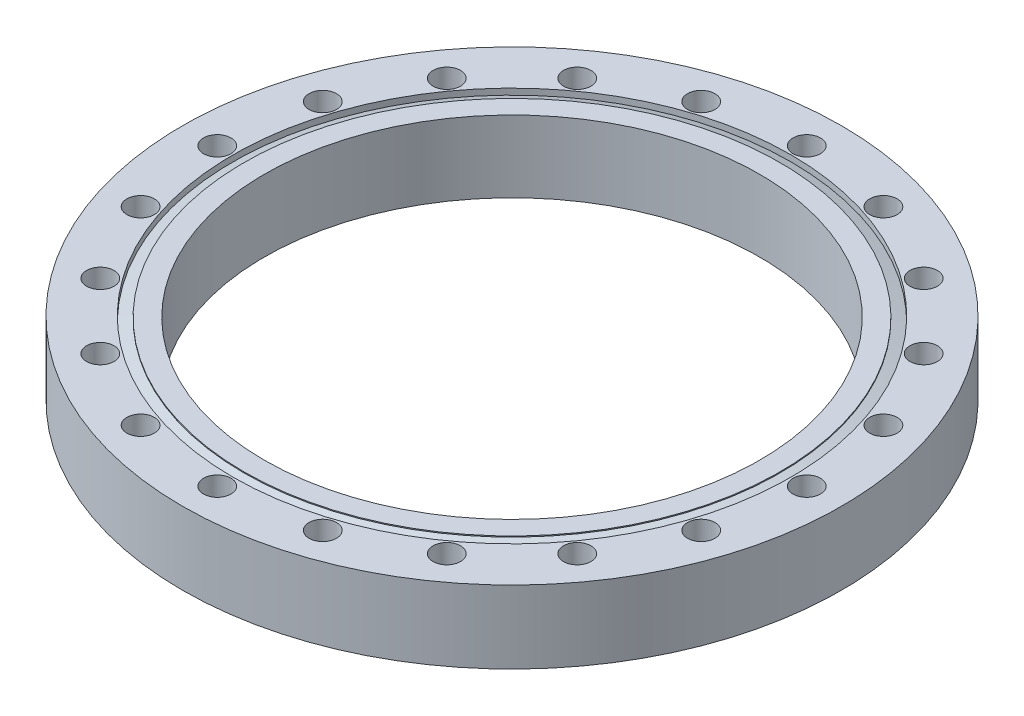
ISO-10303-21;
HEADER;
FILE_DESCRIPTION(('STEP AP214'),'2;1');
FILE_NAME('part.step','',(''),(''),'','','');
FILE_SCHEMA(('AUTOMOTIVE_DESIGN { 1 0 10303 214 1 1 1 1 }'));
ENDSEC;
DATA;
#1=APPLICATION_CONTEXT('core data for automotive mechanical design processes');
#2=APPLICATION_PROTOCOL_DEFINITION('international standard','automotive_design',2000,#1);
#3=PRODUCT_CONTEXT('',#1,'mechanical');
#4=PRODUCT('Part','Part','',(#3));
#5=PRODUCT_RELATED_PRODUCT_CATEGORY('part','',(#4));
#6=PRODUCT_DEFINITION_FORMATION('','',#4);
#7=PRODUCT_DEFINITION_CONTEXT('part definition',#1,'design');
#8=PRODUCT_DEFINITION('design','',#6,#7);
#9=PRODUCT_DEFINITION_SHAPE('','',#8);
#10=(LENGTH_UNIT() NAMED_UNIT(*) SI_UNIT(.MILLI.,.METRE.));
#11=(NAMED_UNIT(*) PLANE_ANGLE_UNIT() SI_UNIT($,.RADIAN.));
#12=(NAMED_UNIT(*) SI_UNIT($,.STERADIAN.) SOLID_ANGLE_UNIT());
#13=UNCERTAINTY_MEASURE_WITH_UNIT(LENGTH_MEASURE(1.E-05),#10,'distance_accuracy_value','');
#14=(GEOMETRIC_REPRESENTATION_CONTEXT(3) GLOBAL_UNCERTAINTY_ASSIGNED_CONTEXT((#13)) GLOBAL_UNIT_ASSIGNED_CONTEXT((#10,
#11,#12)) REPRESENTATION_CONTEXT('',''));
#15=CARTESIAN_POINT('',(0.,0.,0.));
#16=DIRECTION('',(0.,0.,1.));
#17=DIRECTION('',(1.,0.,0.));
#18=AXIS2_PLACEMENT_3D('',#15,#16,#17);
#19=CARTESIAN_POINT('',(101.219,11.176,0.));
#20=DIRECTION('',(0.,-1.,0.));
#21=DIRECTION('',(0.,0.,-1.));
#22=AXIS2_PLACEMENT_3D('',#19,#20,#21);
#23=PLANE('',#22);
#24=CARTESIAN_POINT('',(73.2367488259894,11.176,53.2096126349265));
#25=DIRECTION('',(0.,1.,0.));
#26=DIRECTION('',(-0.587785252292462,0.,0.809016994374955));
#27=AXIS2_PLACEMENT_3D('',#24,#25,#26);
#28=CIRCLE('',#27,4.21639999999999);
#29=CARTESIAN_POINT('',(70.7584110882235,11.176,56.6207518900091));
#30=VERTEX_POINT('',#29);
#31=EDGE_CURVE('E172',#30,#30,#28,.T.);
#32=ORIENTED_EDGE('',*,*,#31,.F.);
#33=EDGE_LOOP('',(#32));
#34=FACE_BOUND('',#33,.T.);
#35=CARTESIAN_POINT('',(27.9739488259897,11.176,86.0949617715282));
#36=DIRECTION('',(0.,1.,0.));
#37=DIRECTION('',(-0.95105651629515,0.,0.309016994374958));
#38=AXIS2_PLACEMENT_3D('',#35,#36,#37);
#39=CIRCLE('',#38,4.21639999999999);
#40=CARTESIAN_POINT('',(23.9639141306828,11.176,87.3979010266108));
#41=VERTEX_POINT('',#40);
#42=EDGE_CURVE('E160',#41,#41,#39,.T.);
#43=ORIENTED_EDGE('',*,*,#42,.F.);
#44=EDGE_LOOP('',(#43));
#45=FACE_BOUND('',#44,.T.);
#46=CARTESIAN_POINT('',(-27.9739488259879,11.176,86.0949617715288));
#47=DIRECTION('',(0.,1.,0.));
#48=DIRECTION('',(-0.951056516295157,0.,-0.309016994374938));
#49=AXIS2_PLACEMENT_3D('',#46,#47,#48);
#50=CIRCLE('',#49,4.21639999999999);
#51=CARTESIAN_POINT('',(-31.9839835212948,11.176,84.7920225164463));
#52=VERTEX_POINT('',#51);
#53=EDGE_CURVE('E148',#52,#52,#50,.T.);
#54=ORIENTED_EDGE('',*,*,#53,.F.);
#55=EDGE_LOOP('',(#54));
#56=FACE_BOUND('',#55,.T.);
#57=CARTESIAN_POINT('',(-73.2367488259883,11.176,53.2096126349281));
#58=DIRECTION('',(0.,1.,0.));
#59=DIRECTION('',(-0.58778525229248,0.,-0.809016994374942));
#60=AXIS2_PLACEMENT_3D('',#57,#58,#59);
#61=CIRCLE('',#60,4.21639999999999);
#62=CARTESIAN_POINT('',(-75.7150865637543,11.176,49.7984733798456));
#63=VERTEX_POINT('',#62);
#64=EDGE_CURVE('E136',#63,#63,#61,.T.);
#65=ORIENTED_EDGE('',*,*,#64,.F.);
#66=EDGE_LOOP('',(#65));
#67=FACE_BOUND('',#66,.T.);
#68=CARTESIAN_POINT('',(-90.5256,11.176,6.32137252308887E-13));
#69=DIRECTION('',(0.,1.,0.));
#70=DIRECTION('',(0.,0.,-1.));
#71=AXIS2_PLACEMENT_3D('',#68,#69,#70);
#72=CIRCLE('',#71,4.21639999999999);
#73=CARTESIAN_POINT('',(-90.5256,11.176,-4.21639999999936));
#74=VERTEX_POINT('',#73);
#75=EDGE_CURVE('E124',#74,#74,#72,.T.);
#76=ORIENTED_EDGE('',*,*,#75,.F.);
#77=EDGE_LOOP('',(#76));
#78=FACE_BOUND('',#77,.T.);
#79=CARTESIAN_POINT('',(-73.236748825989,11.176,-53.2096126349271));
#80=DIRECTION('',(0.,1.,0.));
#81=DIRECTION('',(0.587785252292469,0.,-0.809016994374951));
#82=AXIS2_PLACEMENT_3D('',#79,#80,#81);
#83=CIRCLE('',#82,4.21639999999999);
#84=CARTESIAN_POINT('',(-70.7584110882231,11.176,-56.6207518900096));
#85=VERTEX_POINT('',#84);
#86=EDGE_CURVE('E112',#85,#85,#83,.T.);
#87=ORIENTED_EDGE('',*,*,#86,.F.);
#88=EDGE_LOOP('',(#87));
#89=FACE_BOUND('',#88,.T.);
#90=CARTESIAN_POINT('',(-27.9739488259891,11.176,-86.0949617715284));
#91=DIRECTION('',(0.,1.,0.));
#92=DIRECTION('',(0.951056516295152,0.,-0.309016994374952));
#93=AXIS2_PLACEMENT_3D('',#90,#91,#92);
#94=CIRCLE('',#93,4.21639999999999);
#95=CARTESIAN_POINT('',(-23.9639141306822,11.176,-87.397901026611));
#96=VERTEX_POINT('',#95);
#97=EDGE_CURVE('E100',#96,#96,#94,.T.);
#98=ORIENTED_EDGE('',*,*,#97,.F.);
#99=EDGE_LOOP('',(#98));
#100=FACE_BOUND('',#99,.T.);
#101=CARTESIAN_POINT('',(27.9739488259885,11.176,-86.0949617715286));
#102=DIRECTION('',(0.,1.,0.));
#103=DIRECTION('',(0.951056516295155,0.,0.309016994374945));
#104=AXIS2_PLACEMENT_3D('',#101,#102,#103);
#105=CIRCLE('',#104,4.21639999999999);
#106=CARTESIAN_POINT('',(31.9839835212954,11.176,-84.7920225164461));
#107=VERTEX_POINT('',#106);
#108=EDGE_CURVE('E88',#107,#107,#105,.T.);
#109=ORIENTED_EDGE('',*,*,#108,.F.);
#110=EDGE_LOOP('',(#109));
#111=FACE_BOUND('',#110,.T.);
#112=CARTESIAN_POINT('',(73.2367488259887,11.176,-53.2096126349276));
#113=DIRECTION('',(0.,1.,0.));
#114=DIRECTION('',(0.587785252292474,0.,0.809016994374947));
#115=AXIS2_PLACEMENT_3D('',#112,#113,#114);
#116=CIRCLE('',#115,4.21639999999999);
#117=CARTESIAN_POINT('',(75.7150865637547,11.176,-49.7984733798451));
#118=VERTEX_POINT('',#117);
#119=EDGE_CURVE('E76',#118,#118,#116,.T.);
#120=ORIENTED_EDGE('',*,*,#119,.F.);
#121=EDGE_LOOP('',(#120));
#122=FACE_BOUND('',#121,.T.);
#123=CARTESIAN_POINT('',(90.5256,11.176,0.));
#124=DIRECTION('',(0.,1.,0.));
#125=DIRECTION('',(0.,0.,1.));
#126=AXIS2_PLACEMENT_3D('',#123,#124,#125);
#127=CIRCLE('',#126,4.21639999999999);
#128=CARTESIAN_POINT('',(90.5256,11.176,4.21639999999999));
#129=VERTEX_POINT('',#128);
#130=EDGE_CURVE('E64',#129,#129,#127,.T.);
#131=ORIENTED_EDGE('',*,*,#130,.F.);
#132=EDGE_LOOP('',(#131));
#133=FACE_BOUND('',#132,.T.);
#134=CARTESIAN_POINT('',(0.,11.176,0.));
#135=DIRECTION('',(0.,1.,0.));
#136=DIRECTION('',(0.,0.,1.));
#137=AXIS2_PLACEMENT_3D('',#134,#135,#136);
#138=CIRCLE('',#137,85.725);
#139=CARTESIAN_POINT('',(0.,11.176,85.725));
#140=VERTEX_POINT('',#139);
#141=EDGE_CURVE('E10',#140,#140,#138,.T.);
#142=ORIENTED_EDGE('',*,*,#141,.F.);
#143=EDGE_LOOP('',(#142));
#144=FACE_BOUND('',#143,.T.);
#145=CARTESIAN_POINT('',(0.,11.176,0.));
#146=DIRECTION('',(0.,1.,0.));
#147=DIRECTION('',(0.,0.,1.));
#148=AXIS2_PLACEMENT_3D('',#145,#146,#147);
#149=CIRCLE('',#148,101.219);
#150=CARTESIAN_POINT('',(0.,11.176,101.219));
#151=VERTEX_POINT('',#150);
#152=EDGE_CURVE('E58',#151,#151,#149,.T.);
#153=ORIENTED_EDGE('',*,*,#152,.T.);
#154=EDGE_LOOP('',(#153));
#155=FACE_BOUND('',#154,.T.);
#156=CARTESIAN_POINT('',(86.0949617715285,11.176,-27.9739488259888));
#157=DIRECTION('',(0.,1.,0.));
#158=DIRECTION('',(0.309016994374948,0.,0.951056516295154));
#159=AXIS2_PLACEMENT_3D('',#156,#157,#158);
#160=CIRCLE('',#159,4.21639999999999);
#161=CARTESIAN_POINT('',(87.3979010266111,11.176,-23.9639141306819));
#162=VERTEX_POINT('',#161);
#163=EDGE_CURVE('E70',#162,#162,#160,.T.);
#164=ORIENTED_EDGE('',*,*,#163,.F.);
#165=EDGE_LOOP('',(#164));
#166=FACE_BOUND('',#165,.T.);
#167=CARTESIAN_POINT('',(53.2096126349273,11.176,-73.2367488259889));
#168=DIRECTION('',(0.,1.,0.));
#169=DIRECTION('',(0.809016994374949,0.,0.587785252292471));
#170=AXIS2_PLACEMENT_3D('',#167,#168,#169);
#171=CIRCLE('',#170,4.21639999999999);
#172=CARTESIAN_POINT('',(56.6207518900099,11.176,-70.7584110882229));
#173=VERTEX_POINT('',#172);
#174=EDGE_CURVE('E82',#173,#173,#171,.T.);
#175=ORIENTED_EDGE('',*,*,#174,.F.);
#176=EDGE_LOOP('',(#175));
#177=FACE_BOUND('',#176,.T.);
#178=CARTESIAN_POINT('',(-3.16068626154443E-13,11.176,-90.5256));
#179=DIRECTION('',(0.,1.,0.));
#180=DIRECTION('',(1.,0.,0.));
#181=AXIS2_PLACEMENT_3D('',#178,#179,#180);
#182=CIRCLE('',#181,4.21639999999999);
#183=CARTESIAN_POINT('',(4.21639999999968,11.176,-90.5256));
#184=VERTEX_POINT('',#183);
#185=EDGE_CURVE('E94',#184,#184,#182,.T.);
#186=ORIENTED_EDGE('',*,*,#185,.F.);
#187=EDGE_LOOP('',(#186));
#188=FACE_BOUND('',#187,.T.);
#189=CARTESIAN_POINT('',(-53.2096126349279,11.176,-73.2367488259885));
#190=DIRECTION('',(0.,1.,0.));
#191=DIRECTION('',(0.809016994374945,0.,-0.587785252292477));
#192=AXIS2_PLACEMENT_3D('',#189,#190,#191);
#193=CIRCLE('',#192,4.21639999999999);
#194=CARTESIAN_POINT('',(-49.7984733798453,11.176,-75.7150865637545));
#195=VERTEX_POINT('',#194);
#196=EDGE_CURVE('E106',#195,#195,#193,.T.);
#197=ORIENTED_EDGE('',*,*,#196,.F.);
#198=EDGE_LOOP('',(#197));
#199=FACE_BOUND('',#198,.T.);
#200=CARTESIAN_POINT('',(-86.0949617715287,11.176,-27.9739488259882));
#201=DIRECTION('',(0.,1.,0.));
#202=DIRECTION('',(0.309016994374941,0.,-0.951056516295156));
#203=AXIS2_PLACEMENT_3D('',#200,#201,#202);
#204=CIRCLE('',#203,4.21639999999999);
#205=CARTESIAN_POINT('',(-84.7920225164462,11.176,-31.9839835212951));
#206=VERTEX_POINT('',#205);
#207=EDGE_CURVE('E118',#206,#206,#204,.T.);
#208=ORIENTED_EDGE('',*,*,#207,.F.);
#209=EDGE_LOOP('',(#208));
#210=FACE_BOUND('',#209,.T.);
#211=CARTESIAN_POINT('',(-86.0949617715283,11.176,27.9739488259894));
#212=DIRECTION('',(0.,1.,0.));
#213=DIRECTION('',(-0.309016994374955,0.,-0.951056516295151));
#214=AXIS2_PLACEMENT_3D('',#211,#212,#213);
#215=CIRCLE('',#214,4.21639999999999);
#216=CARTESIAN_POINT('',(-87.3979010266109,11.176,23.9639141306826));
#217=VERTEX_POINT('',#216);
#218=EDGE_CURVE('E130',#217,#217,#215,.T.);
#219=ORIENTED_EDGE('',*,*,#218,.F.);
#220=EDGE_LOOP('',(#219));
#221=FACE_BOUND('',#220,.T.);
#222=CARTESIAN_POINT('',(-53.2096126349268,11.176,73.2367488259893));
#223=DIRECTION('',(0.,1.,0.));
#224=DIRECTION('',(-0.809016994374953,0.,-0.587785252292465));
#225=AXIS2_PLACEMENT_3D('',#222,#223,#224);
#226=CIRCLE('',#225,4.21639999999999);
#227=CARTESIAN_POINT('',(-56.6207518900093,11.176,70.7584110882233));
#228=VERTEX_POINT('',#227);
#229=EDGE_CURVE('E142',#228,#228,#226,.T.);
#230=ORIENTED_EDGE('',*,*,#229,.F.);
#231=EDGE_LOOP('',(#230));
#232=FACE_BOUND('',#231,.T.);
#233=CARTESIAN_POINT('',(9.4820587846333E-13,11.176,90.5256));
#234=DIRECTION('',(0.,1.,0.));
#235=DIRECTION('',(-1.,0.,0.));
#236=AXIS2_PLACEMENT_3D('',#233,#234,#235);
#237=CIRCLE('',#236,4.21639999999999);
#238=CARTESIAN_POINT('',(-4.21639999999905,11.176,90.5256));
#239=VERTEX_POINT('',#238);
#240=EDGE_CURVE('E154',#239,#239,#237,.T.);
#241=ORIENTED_EDGE('',*,*,#240,.F.);
#242=EDGE_LOOP('',(#241));
#243=FACE_BOUND('',#242,.T.);
#244=CARTESIAN_POINT('',(53.2096126349284,11.176,73.2367488259881));
#245=DIRECTION('',(0.,1.,0.));
#246=DIRECTION('',(-0.80901699437494,0.,0.587785252292483));
#247=AXIS2_PLACEMENT_3D('',#244,#245,#246);
#248=CIRCLE('',#247,4.21639999999999);
#249=CARTESIAN_POINT('',(49.7984733798459,11.176,75.7150865637541));
#250=VERTEX_POINT('',#249);
#251=EDGE_CURVE('E166',#250,#250,#248,.T.);
#252=ORIENTED_EDGE('',*,*,#251,.F.);
#253=EDGE_LOOP('',(#252));
#254=FACE_BOUND('',#253,.T.);
#255=CARTESIAN_POINT('',(86.0949617715289,11.176,27.9739488259876));
#256=DIRECTION('',(0.,1.,0.));
#257=DIRECTION('',(-0.309016994374935,0.,0.951056516295158));
#258=AXIS2_PLACEMENT_3D('',#255,#256,#257);
#259=CIRCLE('',#258,4.21639999999999);
#260=CARTESIAN_POINT('',(84.7920225164465,11.176,31.9839835212945));
#261=VERTEX_POINT('',#260);
#262=EDGE_CURVE('E178',#261,#261,#259,.T.);
#263=ORIENTED_EDGE('',*,*,#262,.F.);
#264=EDGE_LOOP('',(#263));
#265=FACE_BOUND('',#264,.T.);
#266=ADVANCED_FACE('F30',(#34,#45,#56,#67,#78,#89,#100,#111,#122,#133,#144,#155,#166,#177,#188,
#199,#210,#221,#232,#243,#254,#265),#23,.F.);
#267=CARTESIAN_POINT('',(76.073,-11.176,0.));
#268=DIRECTION('',(0.,1.,0.));
#269=DIRECTION('',(0.,0.,1.));
#270=AXIS2_PLACEMENT_3D('',#267,#268,#269);
#271=PLANE('',#270);
#272=CARTESIAN_POINT('',(73.2367488259894,-11.176,53.2096126349265));
#273=DIRECTION('',(0.,1.,0.));
#274=DIRECTION('',(-0.587785252292462,0.,0.809016994374955));
#275=AXIS2_PLACEMENT_3D('',#272,#273,#274);
#276=CIRCLE('',#275,4.21639999999999);
#277=CARTESIAN_POINT('',(70.7584110882235,-11.176,56.6207518900091));
#278=VERTEX_POINT('',#277);
#279=EDGE_CURVE('E169',#278,#278,#276,.T.);
#280=ORIENTED_EDGE('',*,*,#279,.T.);
#281=EDGE_LOOP('',(#280));
#282=FACE_BOUND('',#281,.T.);
#283=CARTESIAN_POINT('',(27.9739488259897,-11.176,86.0949617715282));
#284=DIRECTION('',(0.,1.,0.));
#285=DIRECTION('',(-0.95105651629515,0.,0.309016994374958));
#286=AXIS2_PLACEMENT_3D('',#283,#284,#285);
#287=CIRCLE('',#286,4.21639999999999);
#288=CARTESIAN_POINT('',(23.9639141306828,-11.176,87.3979010266108));
#289=VERTEX_POINT('',#288);
#290=EDGE_CURVE('E157',#289,#289,#287,.T.);
#291=ORIENTED_EDGE('',*,*,#290,.T.);
#292=EDGE_LOOP('',(#291));
#293=FACE_BOUND('',#292,.T.);
#294=CARTESIAN_POINT('',(-27.9739488259879,-11.176,86.0949617715288));
#295=DIRECTION('',(0.,1.,0.));
#296=DIRECTION('',(-0.951056516295157,0.,-0.309016994374938));
#297=AXIS2_PLACEMENT_3D('',#294,#295,#296);
#298=CIRCLE('',#297,4.21639999999999);
#299=CARTESIAN_POINT('',(-31.9839835212948,-11.176,84.7920225164463));
#300=VERTEX_POINT('',#299);
#301=EDGE_CURVE('E145',#300,#300,#298,.T.);
#302=ORIENTED_EDGE('',*,*,#301,.T.);
#303=EDGE_LOOP('',(#302));
#304=FACE_BOUND('',#303,.T.);
#305=CARTESIAN_POINT('',(-73.2367488259883,-11.176,53.2096126349281));
#306=DIRECTION('',(0.,1.,0.));
#307=DIRECTION('',(-0.58778525229248,0.,-0.809016994374942));
#308=AXIS2_PLACEMENT_3D('',#305,#306,#307);
#309=CIRCLE('',#308,4.21639999999999);
#310=CARTESIAN_POINT('',(-75.7150865637543,-11.176,49.7984733798456));
#311=VERTEX_POINT('',#310);
#312=EDGE_CURVE('E133',#311,#311,#309,.T.);
#313=ORIENTED_EDGE('',*,*,#312,.T.);
#314=EDGE_LOOP('',(#313));
#315=FACE_BOUND('',#314,.T.);
#316=CARTESIAN_POINT('',(-90.5256,-11.176,6.32137252308887E-13));
#317=DIRECTION('',(0.,1.,0.));
#318=DIRECTION('',(0.,0.,-1.));
#319=AXIS2_PLACEMENT_3D('',#316,#317,#318);
#320=CIRCLE('',#319,4.21639999999999);
#321=CARTESIAN_POINT('',(-90.5256,-11.176,-4.21639999999936));
#322=VERTEX_POINT('',#321);
#323=EDGE_CURVE('E121',#322,#322,#320,.T.);
#324=ORIENTED_EDGE('',*,*,#323,.T.);
#325=EDGE_LOOP('',(#324));
#326=FACE_BOUND('',#325,.T.);
#327=CARTESIAN_POINT('',(-73.236748825989,-11.176,-53.2096126349271));
#328=DIRECTION('',(0.,1.,0.));
#329=DIRECTION('',(0.587785252292469,0.,-0.809016994374951));
#330=AXIS2_PLACEMENT_3D('',#327,#328,#329);
#331=CIRCLE('',#330,4.21639999999999);
#332=CARTESIAN_POINT('',(-70.7584110882231,-11.176,-56.6207518900096));
#333=VERTEX_POINT('',#332);
#334=EDGE_CURVE('E109',#333,#333,#331,.T.);
#335=ORIENTED_EDGE('',*,*,#334,.T.);
#336=EDGE_LOOP('',(#335));
#337=FACE_BOUND('',#336,.T.);
#338=CARTESIAN_POINT('',(-27.9739488259891,-11.176,-86.0949617715284));
#339=DIRECTION('',(0.,1.,0.));
#340=DIRECTION('',(0.951056516295152,0.,-0.309016994374952));
#341=AXIS2_PLACEMENT_3D('',#338,#339,#340);
#342=CIRCLE('',#341,4.21639999999999);
#343=CARTESIAN_POINT('',(-23.9639141306822,-11.176,-87.397901026611));
#344=VERTEX_POINT('',#343);
#345=EDGE_CURVE('E97',#344,#344,#342,.T.);
#346=ORIENTED_EDGE('',*,*,#345,.T.);
#347=EDGE_LOOP('',(#346));
#348=FACE_BOUND('',#347,.T.);
#349=CARTESIAN_POINT('',(27.9739488259885,-11.176,-86.0949617715286));
#350=DIRECTION('',(0.,1.,0.));
#351=DIRECTION('',(0.951056516295155,0.,0.309016994374945));
#352=AXIS2_PLACEMENT_3D('',#349,#350,#351);
#353=CIRCLE('',#352,4.21639999999999);
#354=CARTESIAN_POINT('',(31.9839835212954,-11.176,-84.7920225164461));
#355=VERTEX_POINT('',#354);
#356=EDGE_CURVE('E85',#355,#355,#353,.T.);
#357=ORIENTED_EDGE('',*,*,#356,.T.);
#358=EDGE_LOOP('',(#357));
#359=FACE_BOUND('',#358,.T.);
#360=CARTESIAN_POINT('',(73.2367488259887,-11.176,-53.2096126349276));
#361=DIRECTION('',(0.,1.,0.));
#362=DIRECTION('',(0.587785252292474,0.,0.809016994374947));
#363=AXIS2_PLACEMENT_3D('',#360,#361,#362);
#364=CIRCLE('',#363,4.21639999999999);
#365=CARTESIAN_POINT('',(75.7150865637547,-11.176,-49.7984733798451));
#366=VERTEX_POINT('',#365);
#367=EDGE_CURVE('E73',#366,#366,#364,.T.);
#368=ORIENTED_EDGE('',*,*,#367,.T.);
#369=EDGE_LOOP('',(#368));
#370=FACE_BOUND('',#369,.T.);
#371=CARTESIAN_POINT('',(90.5256,-11.176,0.));
#372=DIRECTION('',(0.,1.,0.));
#373=DIRECTION('',(0.,0.,1.));
#374=AXIS2_PLACEMENT_3D('',#371,#372,#373);
#375=CIRCLE('',#374,4.21639999999999);
#376=CARTESIAN_POINT('',(90.5256,-11.176,4.21639999999999));
#377=VERTEX_POINT('',#376);
#378=EDGE_CURVE('E61',#377,#377,#375,.T.);
#379=ORIENTED_EDGE('',*,*,#378,.T.);
#380=EDGE_LOOP('',(#379));
#381=FACE_BOUND('',#380,.T.);
#382=CARTESIAN_POINT('',(0.,-11.176,0.));
#383=DIRECTION('',(0.,1.,0.));
#384=DIRECTION('',(0.,0.,1.));
#385=AXIS2_PLACEMENT_3D('',#382,#383,#384);
#386=CIRCLE('',#385,101.219);
#387=CARTESIAN_POINT('',(0.,-11.176,101.219));
#388=VERTEX_POINT('',#387);
#389=EDGE_CURVE('E55',#388,#388,#386,.T.);
#390=ORIENTED_EDGE('',*,*,#389,.F.);
#391=EDGE_LOOP('',(#390));
#392=FACE_BOUND('',#391,.T.);
#393=CARTESIAN_POINT('',(0.,-11.176,0.));
#394=DIRECTION('',(0.,1.,0.));
#395=DIRECTION('',(0.,0.,1.));
#396=AXIS2_PLACEMENT_3D('',#393,#394,#395);
#397=CIRCLE('',#396,76.073);
#398=CARTESIAN_POINT('',(0.,-11.176,76.073));
#399=VERTEX_POINT('',#398);
#400=EDGE_CURVE('E52',#399,#399,#397,.T.);
#401=ORIENTED_EDGE('',*,*,#400,.T.);
#402=EDGE_LOOP('',(#401));
#403=FACE_BOUND('',#402,.T.);
#404=CARTESIAN_POINT('',(86.0949617715285,-11.176,-27.9739488259888));
#405=DIRECTION('',(0.,1.,0.));
#406=DIRECTION('',(0.309016994374948,0.,0.951056516295154));
#407=AXIS2_PLACEMENT_3D('',#404,#405,#406);
#408=CIRCLE('',#407,4.21639999999999);
#409=CARTESIAN_POINT('',(87.3979010266111,-11.176,-23.9639141306819));
#410=VERTEX_POINT('',#409);
#411=EDGE_CURVE('E67',#410,#410,#408,.T.);
#412=ORIENTED_EDGE('',*,*,#411,.T.);
#413=EDGE_LOOP('',(#412));
#414=FACE_BOUND('',#413,.T.);
#415=CARTESIAN_POINT('',(53.2096126349273,-11.176,-73.2367488259889));
#416=DIRECTION('',(0.,1.,0.));
#417=DIRECTION('',(0.809016994374949,0.,0.587785252292471));
#418=AXIS2_PLACEMENT_3D('',#415,#416,#417);
#419=CIRCLE('',#418,4.21639999999999);
#420=CARTESIAN_POINT('',(56.6207518900099,-11.176,-70.7584110882229));
#421=VERTEX_POINT('',#420);
#422=EDGE_CURVE('E79',#421,#421,#419,.T.);
#423=ORIENTED_EDGE('',*,*,#422,.T.);
#424=EDGE_LOOP('',(#423));
#425=FACE_BOUND('',#424,.T.);
#426=CARTESIAN_POINT('',(-3.16068626154443E-13,-11.176,-90.5256));
#427=DIRECTION('',(0.,1.,0.));
#428=DIRECTION('',(1.,0.,0.));
#429=AXIS2_PLACEMENT_3D('',#426,#427,#428);
#430=CIRCLE('',#429,4.21639999999999);
#431=CARTESIAN_POINT('',(4.21639999999968,-11.176,-90.5256));
#432=VERTEX_POINT('',#431);
#433=EDGE_CURVE('E91',#432,#432,#430,.T.);
#434=ORIENTED_EDGE('',*,*,#433,.T.);
#435=EDGE_LOOP('',(#434));
#436=FACE_BOUND('',#435,.T.);
#437=CARTESIAN_POINT('',(-53.2096126349279,-11.176,-73.2367488259885));
#438=DIRECTION('',(0.,1.,0.));
#439=DIRECTION('',(0.809016994374945,0.,-0.587785252292477));
#440=AXIS2_PLACEMENT_3D('',#437,#438,#439);
#441=CIRCLE('',#440,4.21639999999999);
#442=CARTESIAN_POINT('',(-49.7984733798453,-11.176,-75.7150865637545));
#443=VERTEX_POINT('',#442);
#444=EDGE_CURVE('E103',#443,#443,#441,.T.);
#445=ORIENTED_EDGE('',*,*,#444,.T.);
#446=EDGE_LOOP('',(#445));
#447=FACE_BOUND('',#446,.T.);
#448=CARTESIAN_POINT('',(-86.0949617715287,-11.176,-27.9739488259882));
#449=DIRECTION('',(0.,1.,0.));
#450=DIRECTION('',(0.309016994374941,0.,-0.951056516295156));
#451=AXIS2_PLACEMENT_3D('',#448,#449,#450);
#452=CIRCLE('',#451,4.21639999999999);
#453=CARTESIAN_POINT('',(-84.7920225164462,-11.176,-31.9839835212951));
#454=VERTEX_POINT('',#453);
#455=EDGE_CURVE('E115',#454,#454,#452,.T.);
#456=ORIENTED_EDGE('',*,*,#455,.T.);
#457=EDGE_LOOP('',(#456));
#458=FACE_BOUND('',#457,.T.);
#459=CARTESIAN_POINT('',(-86.0949617715283,-11.176,27.9739488259894));
#460=DIRECTION('',(0.,1.,0.));
#461=DIRECTION('',(-0.309016994374955,0.,-0.951056516295151));
#462=AXIS2_PLACEMENT_3D('',#459,#460,#461);
#463=CIRCLE('',#462,4.21639999999999);
#464=CARTESIAN_POINT('',(-87.3979010266109,-11.176,23.9639141306826));
#465=VERTEX_POINT('',#464);
#466=EDGE_CURVE('E127',#465,#465,#463,.T.);
#467=ORIENTED_EDGE('',*,*,#466,.T.);
#468=EDGE_LOOP('',(#467));
#469=FACE_BOUND('',#468,.T.);
#470=CARTESIAN_POINT('',(-53.2096126349268,-11.176,73.2367488259893));
#471=DIRECTION('',(0.,1.,0.));
#472=DIRECTION('',(-0.809016994374953,0.,-0.587785252292465));
#473=AXIS2_PLACEMENT_3D('',#470,#471,#472);
#474=CIRCLE('',#473,4.21639999999999);
#475=CARTESIAN_POINT('',(-56.6207518900093,-11.176,70.7584110882233));
#476=VERTEX_POINT('',#475);
#477=EDGE_CURVE('E139',#476,#476,#474,.T.);
#478=ORIENTED_EDGE('',*,*,#477,.T.);
#479=EDGE_LOOP('',(#478));
#480=FACE_BOUND('',#479,.T.);
#481=CARTESIAN_POINT('',(9.4820587846333E-13,-11.176,90.5256));
#482=DIRECTION('',(0.,1.,0.));
#483=DIRECTION('',(-1.,0.,0.));
#484=AXIS2_PLACEMENT_3D('',#481,#482,#483);
#485=CIRCLE('',#484,4.21639999999999);
#486=CARTESIAN_POINT('',(-4.21639999999905,-11.176,90.5256));
#487=VERTEX_POINT('',#486);
#488=EDGE_CURVE('E151',#487,#487,#485,.T.);
#489=ORIENTED_EDGE('',*,*,#488,.T.);
#490=EDGE_LOOP('',(#489));
#491=FACE_BOUND('',#490,.T.);
#492=CARTESIAN_POINT('',(53.2096126349284,-11.176,73.2367488259881));
#493=DIRECTION('',(0.,1.,0.));
#494=DIRECTION('',(-0.80901699437494,0.,0.587785252292483));
#495=AXIS2_PLACEMENT_3D('',#492,#493,#494);
#496=CIRCLE('',#495,4.21639999999999);
#497=CARTESIAN_POINT('',(49.7984733798459,-11.176,75.7150865637541));
#498=VERTEX_POINT('',#497);
#499=EDGE_CURVE('E163',#498,#498,#496,.T.);
#500=ORIENTED_EDGE('',*,*,#499,.T.);
#501=EDGE_LOOP('',(#500));
#502=FACE_BOUND('',#501,.T.);
#503=CARTESIAN_POINT('',(86.0949617715289,-11.176,27.9739488259876));
#504=DIRECTION('',(0.,1.,0.));
#505=DIRECTION('',(-0.309016994374935,0.,0.951056516295158));
#506=AXIS2_PLACEMENT_3D('',#503,#504,#505);
#507=CIRCLE('',#506,4.21639999999999);
#508=CARTESIAN_POINT('',(84.7920225164465,-11.176,31.9839835212945));
#509=VERTEX_POINT('',#508);
#510=EDGE_CURVE('E175',#509,#509,#507,.T.);
#511=ORIENTED_EDGE('',*,*,#510,.T.);
#512=EDGE_LOOP('',(#511));
#513=FACE_BOUND('',#512,.T.);
#514=ADVANCED_FACE('F186',(#282,#293,#304,#315,#326,#337,#348,#359,#370,#381,#392,#403,#414,
#425,#436,#447,#458,#469,#480,#491,#502,#513),#271,.F.);
#515=CARTESIAN_POINT('',(0.,42.3692277299739,0.));
#516=DIRECTION('',(0.,1.,0.));
#517=DIRECTION('',(0.,0.,1.));
#518=AXIS2_PLACEMENT_3D('',#515,#516,#517);
#519=CYLINDRICAL_SURFACE('',#518,85.725);
#520=CARTESIAN_POINT('',(0.,9.29294606670119,0.));
#521=DIRECTION('',(0.,1.,0.));
#522=DIRECTION('',(0.,0.,1.));
#523=AXIS2_PLACEMENT_3D('',#520,#521,#522);
#524=CIRCLE('',#523,85.725);
#525=CARTESIAN_POINT('',(0.,9.29294606670119,85.725));
#526=VERTEX_POINT('',#525);
#527=EDGE_CURVE('E36',#526,#526,#524,.T.);
#528=ORIENTED_EDGE('',*,*,#527,.F.);
#529=EDGE_LOOP('',(#528));
#530=FACE_BOUND('',#529,.T.);
#531=ORIENTED_EDGE('',*,*,#141,.T.);
#532=EDGE_LOOP('',(#531));
#533=FACE_BOUND('',#532,.T.);
#534=ADVANCED_FACE('F191',(#530,#533),#519,.F.);
#535=CARTESIAN_POINT('',(0.,9.29294606670119,0.));
#536=DIRECTION('',(0.,-1.,0.));
#537=DIRECTION('',(0.,0.,-1.));
#538=AXIS2_PLACEMENT_3D('',#535,#536,#537);
#539=CONICAL_SURFACE('',#538,85.725,1.22173047639603);
#540=CARTESIAN_POINT('',(0.,10.541,0.));
#541=DIRECTION('',(0.,1.,0.));
#542=DIRECTION('',(0.,0.,1.));
#543=AXIS2_PLACEMENT_3D('',#540,#541,#542);
#544=CIRCLE('',#543,82.296);
#545=CARTESIAN_POINT('',(0.,10.541,82.296));
#546=VERTEX_POINT('',#545);
#547=EDGE_CURVE('E40',#546,#546,#544,.T.);
#548=ORIENTED_EDGE('',*,*,#547,.F.);
#549=EDGE_LOOP('',(#548));
#550=FACE_BOUND('',#549,.T.);
#551=ORIENTED_EDGE('',*,*,#527,.T.);
#552=EDGE_LOOP('',(#551));
#553=FACE_BOUND('',#552,.T.);
#554=ADVANCED_FACE('F335',(#550,#553),#539,.T.);
#555=CARTESIAN_POINT('',(0.,42.3692277299739,0.));
#556=DIRECTION('',(0.,1.,0.));
#557=DIRECTION('',(0.,0.,1.));
#558=AXIS2_PLACEMENT_3D('',#555,#556,#557);
#559=CYLINDRICAL_SURFACE('',#558,82.296);
#560=CARTESIAN_POINT('',(0.,10.8521616758001,0.));
#561=DIRECTION('',(0.,1.,0.));
#562=DIRECTION('',(0.,0.,1.));
#563=AXIS2_PLACEMENT_3D('',#560,#561,#562);
#564=CIRCLE('',#563,82.296);
#565=CARTESIAN_POINT('',(0.,10.8521616758001,82.296));
#566=VERTEX_POINT('',#565);
#567=EDGE_CURVE('E44',#566,#566,#564,.T.);
#568=ORIENTED_EDGE('',*,*,#567,.F.);
#569=EDGE_LOOP('',(#568));
#570=FACE_BOUND('',#569,.T.);
#571=ORIENTED_EDGE('',*,*,#547,.T.);
#572=EDGE_LOOP('',(#571));
#573=FACE_BOUND('',#572,.T.);
#574=ADVANCED_FACE('F331',(#570,#573),#559,.T.);
#575=CARTESIAN_POINT('',(76.073,10.8521616758001,0.));
#576=DIRECTION('',(0.,-1.,0.));
#577=DIRECTION('',(0.,0.,-1.));
#578=AXIS2_PLACEMENT_3D('',#575,#576,#577);
#579=PLANE('',#578);
#580=CARTESIAN_POINT('',(0.,10.8521616758001,0.));
#581=DIRECTION('',(0.,1.,0.));
#582=DIRECTION('',(0.,0.,1.));
#583=AXIS2_PLACEMENT_3D('',#580,#581,#582);
#584=CIRCLE('',#583,76.073);
#585=CARTESIAN_POINT('',(0.,10.8521616758001,76.073));
#586=VERTEX_POINT('',#585);
#587=EDGE_CURVE('E49',#586,#586,#584,.T.);
#588=ORIENTED_EDGE('',*,*,#587,.F.);
#589=EDGE_LOOP('',(#588));
#590=FACE_BOUND('',#589,.T.);
#591=ORIENTED_EDGE('',*,*,#567,.T.);
#592=EDGE_LOOP('',(#591));
#593=FACE_BOUND('',#592,.T.);
#594=ADVANCED_FACE('F327',(#590,#593),#579,.F.);
#595=CARTESIAN_POINT('',(0.,42.3692277299739,0.));
#596=DIRECTION('',(0.,1.,0.));
#597=DIRECTION('',(0.,0.,1.));
#598=AXIS2_PLACEMENT_3D('',#595,#596,#597);
#599=CYLINDRICAL_SURFACE('',#598,76.073);
#600=ORIENTED_EDGE('',*,*,#400,.F.);
#601=EDGE_LOOP('',(#600));
#602=FACE_BOUND('',#601,.T.);
#603=ORIENTED_EDGE('',*,*,#587,.T.);
#604=EDGE_LOOP('',(#603));
#605=FACE_BOUND('',#604,.T.);
#606=ADVANCED_FACE('F322',(#602,#605),#599,.F.);
#607=CARTESIAN_POINT('',(0.,42.3692277299739,0.));
#608=DIRECTION('',(0.,1.,0.));
#609=DIRECTION('',(0.,0.,1.));
#610=AXIS2_PLACEMENT_3D('',#607,#608,#609);
#611=CYLINDRICAL_SURFACE('',#610,101.219);
#612=ORIENTED_EDGE('',*,*,#152,.F.);
#613=EDGE_LOOP('',(#612));
#614=FACE_BOUND('',#613,.T.);
#615=ORIENTED_EDGE('',*,*,#389,.T.);
#616=EDGE_LOOP('',(#615));
#617=FACE_BOUND('',#616,.T.);
#618=ADVANCED_FACE('F319',(#614,#617),#611,.T.);
#619=CARTESIAN_POINT('',(90.5256,40.3260486145421,0.));
#620=DIRECTION('',(0.,1.,0.));
#621=DIRECTION('',(0.,0.,1.));
#622=AXIS2_PLACEMENT_3D('',#619,#620,#621);
#623=CYLINDRICAL_SURFACE('',#622,4.21639999999999);
#624=ORIENTED_EDGE('',*,*,#130,.T.);
#625=EDGE_LOOP('',(#624));
#626=FACE_BOUND('',#625,.T.);
#627=ORIENTED_EDGE('',*,*,#378,.F.);
#628=EDGE_LOOP('',(#627));
#629=FACE_BOUND('',#628,.T.);
#630=ADVANCED_FACE('F315',(#626,#629),#623,.F.);
#631=CARTESIAN_POINT('',(86.0949617715285,40.3260486145421,-27.9739488259888));
#632=DIRECTION('',(0.,1.,0.));
#633=DIRECTION('',(0.309016994374948,0.,0.951056516295154));
#634=AXIS2_PLACEMENT_3D('',#631,#632,#633);
#635=CYLINDRICAL_SURFACE('',#634,4.21639999999999);
#636=ORIENTED_EDGE('',*,*,#163,.T.);
#637=EDGE_LOOP('',(#636));
#638=FACE_BOUND('',#637,.T.);
#639=ORIENTED_EDGE('',*,*,#411,.F.);
#640=EDGE_LOOP('',(#639));
#641=FACE_BOUND('',#640,.T.);
#642=ADVANCED_FACE('F311',(#638,#641),#635,.F.);
#643=CARTESIAN_POINT('',(73.2367488259887,40.3260486145421,-53.2096126349276));
#644=DIRECTION('',(0.,1.,0.));
#645=DIRECTION('',(0.587785252292474,0.,0.809016994374947));
#646=AXIS2_PLACEMENT_3D('',#643,#644,#645);
#647=CYLINDRICAL_SURFACE('',#646,4.21639999999999);
#648=ORIENTED_EDGE('',*,*,#119,.T.);
#649=EDGE_LOOP('',(#648));
#650=FACE_BOUND('',#649,.T.);
#651=ORIENTED_EDGE('',*,*,#367,.F.);
#652=EDGE_LOOP('',(#651));
#653=FACE_BOUND('',#652,.T.);
#654=ADVANCED_FACE('F307',(#650,#653),#647,.F.);
#655=CARTESIAN_POINT('',(53.2096126349273,40.3260486145421,-73.2367488259889));
#656=DIRECTION('',(0.,1.,0.));
#657=DIRECTION('',(0.809016994374949,0.,0.587785252292471));
#658=AXIS2_PLACEMENT_3D('',#655,#656,#657);
#659=CYLINDRICAL_SURFACE('',#658,4.21639999999999);
#660=ORIENTED_EDGE('',*,*,#174,.T.);
#661=EDGE_LOOP('',(#660));
#662=FACE_BOUND('',#661,.T.);
#663=ORIENTED_EDGE('',*,*,#422,.F.);
#664=EDGE_LOOP('',(#663));
#665=FACE_BOUND('',#664,.T.);
#666=ADVANCED_FACE('F303',(#662,#665),#659,.F.);
#667=CARTESIAN_POINT('',(27.9739488259885,40.3260486145421,-86.0949617715286));
#668=DIRECTION('',(0.,1.,0.));
#669=DIRECTION('',(0.951056516295155,0.,0.309016994374945));
#670=AXIS2_PLACEMENT_3D('',#667,#668,#669);
#671=CYLINDRICAL_SURFACE('',#670,4.21639999999999);
#672=ORIENTED_EDGE('',*,*,#108,.T.);
#673=EDGE_LOOP('',(#672));
#674=FACE_BOUND('',#673,.T.);
#675=ORIENTED_EDGE('',*,*,#356,.F.);
#676=EDGE_LOOP('',(#675));
#677=FACE_BOUND('',#676,.T.);
#678=ADVANCED_FACE('F299',(#674,#677),#671,.F.);
#679=CARTESIAN_POINT('',(-3.16068626154443E-13,40.3260486145421,-90.5256));
#680=DIRECTION('',(0.,1.,0.));
#681=DIRECTION('',(1.,0.,0.));
#682=AXIS2_PLACEMENT_3D('',#679,#680,#681);
#683=CYLINDRICAL_SURFACE('',#682,4.21639999999999);
#684=ORIENTED_EDGE('',*,*,#185,.T.);
#685=EDGE_LOOP('',(#684));
#686=FACE_BOUND('',#685,.T.);
#687=ORIENTED_EDGE('',*,*,#433,.F.);
#688=EDGE_LOOP('',(#687));
#689=FACE_BOUND('',#688,.T.);
#690=ADVANCED_FACE('F295',(#686,#689),#683,.F.);
#691=CARTESIAN_POINT('',(-27.9739488259891,40.3260486145421,-86.0949617715284));
#692=DIRECTION('',(0.,1.,0.));
#693=DIRECTION('',(0.951056516295152,0.,-0.309016994374952));
#694=AXIS2_PLACEMENT_3D('',#691,#692,#693);
#695=CYLINDRICAL_SURFACE('',#694,4.21639999999999);
#696=ORIENTED_EDGE('',*,*,#97,.T.);
#697=EDGE_LOOP('',(#696));
#698=FACE_BOUND('',#697,.T.);
#699=ORIENTED_EDGE('',*,*,#345,.F.);
#700=EDGE_LOOP('',(#699));
#701=FACE_BOUND('',#700,.T.);
#702=ADVANCED_FACE('F291',(#698,#701),#695,.F.);
#703=CARTESIAN_POINT('',(-53.2096126349279,40.3260486145421,-73.2367488259885));
#704=DIRECTION('',(0.,1.,0.));
#705=DIRECTION('',(0.809016994374945,0.,-0.587785252292477));
#706=AXIS2_PLACEMENT_3D('',#703,#704,#705);
#707=CYLINDRICAL_SURFACE('',#706,4.21639999999999);
#708=ORIENTED_EDGE('',*,*,#196,.T.);
#709=EDGE_LOOP('',(#708));
#710=FACE_BOUND('',#709,.T.);
#711=ORIENTED_EDGE('',*,*,#444,.F.);
#712=EDGE_LOOP('',(#711));
#713=FACE_BOUND('',#712,.T.);
#714=ADVANCED_FACE('F287',(#710,#713),#707,.F.);
#715=CARTESIAN_POINT('',(-73.236748825989,40.3260486145421,-53.2096126349271));
#716=DIRECTION('',(0.,1.,0.));
#717=DIRECTION('',(0.587785252292469,0.,-0.809016994374951));
#718=AXIS2_PLACEMENT_3D('',#715,#716,#717);
#719=CYLINDRICAL_SURFACE('',#718,4.21639999999999);
#720=ORIENTED_EDGE('',*,*,#86,.T.);
#721=EDGE_LOOP('',(#720));
#722=FACE_BOUND('',#721,.T.);
#723=ORIENTED_EDGE('',*,*,#334,.F.);
#724=EDGE_LOOP('',(#723));
#725=FACE_BOUND('',#724,.T.);
#726=ADVANCED_FACE('F283',(#722,#725),#719,.F.);
#727=CARTESIAN_POINT('',(-86.0949617715287,40.3260486145421,-27.9739488259882));
#728=DIRECTION('',(0.,1.,0.));
#729=DIRECTION('',(0.309016994374941,0.,-0.951056516295156));
#730=AXIS2_PLACEMENT_3D('',#727,#728,#729);
#731=CYLINDRICAL_SURFACE('',#730,4.21639999999999);
#732=ORIENTED_EDGE('',*,*,#207,.T.);
#733=EDGE_LOOP('',(#732));
#734=FACE_BOUND('',#733,.T.);
#735=ORIENTED_EDGE('',*,*,#455,.F.);
#736=EDGE_LOOP('',(#735));
#737=FACE_BOUND('',#736,.T.);
#738=ADVANCED_FACE('F279',(#734,#737),#731,.F.);
#739=CARTESIAN_POINT('',(-90.5256,40.3260486145421,6.32137252308887E-13));
#740=DIRECTION('',(0.,1.,0.));
#741=DIRECTION('',(0.,0.,-1.));
#742=AXIS2_PLACEMENT_3D('',#739,#740,#741);
#743=CYLINDRICAL_SURFACE('',#742,4.21639999999999);
#744=ORIENTED_EDGE('',*,*,#75,.T.);
#745=EDGE_LOOP('',(#744));
#746=FACE_BOUND('',#745,.T.);
#747=ORIENTED_EDGE('',*,*,#323,.F.);
#748=EDGE_LOOP('',(#747));
#749=FACE_BOUND('',#748,.T.);
#750=ADVANCED_FACE('F275',(#746,#749),#743,.F.);
#751=CARTESIAN_POINT('',(-86.0949617715283,40.3260486145421,27.9739488259894));
#752=DIRECTION('',(0.,1.,0.));
#753=DIRECTION('',(-0.309016994374955,0.,-0.951056516295151));
#754=AXIS2_PLACEMENT_3D('',#751,#752,#753);
#755=CYLINDRICAL_SURFACE('',#754,4.21639999999999);
#756=ORIENTED_EDGE('',*,*,#218,.T.);
#757=EDGE_LOOP('',(#756));
#758=FACE_BOUND('',#757,.T.);
#759=ORIENTED_EDGE('',*,*,#466,.F.);
#760=EDGE_LOOP('',(#759));
#761=FACE_BOUND('',#760,.T.);
#762=ADVANCED_FACE('F271',(#758,#761),#755,.F.);
#763=CARTESIAN_POINT('',(-73.2367488259883,40.3260486145421,53.2096126349281));
#764=DIRECTION('',(0.,1.,0.));
#765=DIRECTION('',(-0.58778525229248,0.,-0.809016994374942));
#766=AXIS2_PLACEMENT_3D('',#763,#764,#765);
#767=CYLINDRICAL_SURFACE('',#766,4.21639999999999);
#768=ORIENTED_EDGE('',*,*,#64,.T.);
#769=EDGE_LOOP('',(#768));
#770=FACE_BOUND('',#769,.T.);
#771=ORIENTED_EDGE('',*,*,#312,.F.);
#772=EDGE_LOOP('',(#771));
#773=FACE_BOUND('',#772,.T.);
#774=ADVANCED_FACE('F267',(#770,#773),#767,.F.);
#775=CARTESIAN_POINT('',(-53.2096126349268,40.3260486145421,73.2367488259893));
#776=DIRECTION('',(0.,1.,0.));
#777=DIRECTION('',(-0.809016994374953,0.,-0.587785252292465));
#778=AXIS2_PLACEMENT_3D('',#775,#776,#777);
#779=CYLINDRICAL_SURFACE('',#778,4.21639999999999);
#780=ORIENTED_EDGE('',*,*,#229,.T.);
#781=EDGE_LOOP('',(#780));
#782=FACE_BOUND('',#781,.T.);
#783=ORIENTED_EDGE('',*,*,#477,.F.);
#784=EDGE_LOOP('',(#783));
#785=FACE_BOUND('',#784,.T.);
#786=ADVANCED_FACE('F263',(#782,#785),#779,.F.);
#787=CARTESIAN_POINT('',(-27.9739488259879,40.3260486145421,86.0949617715288));
#788=DIRECTION('',(0.,1.,0.));
#789=DIRECTION('',(-0.951056516295157,0.,-0.309016994374938));
#790=AXIS2_PLACEMENT_3D('',#787,#788,#789);
#791=CYLINDRICAL_SURFACE('',#790,4.21639999999999);
#792=ORIENTED_EDGE('',*,*,#53,.T.);
#793=EDGE_LOOP('',(#792));
#794=FACE_BOUND('',#793,.T.);
#795=ORIENTED_EDGE('',*,*,#301,.F.);
#796=EDGE_LOOP('',(#795));
#797=FACE_BOUND('',#796,.T.);
#798=ADVANCED_FACE('F259',(#794,#797),#791,.F.);
#799=CARTESIAN_POINT('',(9.4820587846333E-13,40.3260486145421,90.5256));
#800=DIRECTION('',(0.,1.,0.));
#801=DIRECTION('',(-1.,0.,0.));
#802=AXIS2_PLACEMENT_3D('',#799,#800,#801);
#803=CYLINDRICAL_SURFACE('',#802,4.21639999999999);
#804=ORIENTED_EDGE('',*,*,#240,.T.);
#805=EDGE_LOOP('',(#804));
#806=FACE_BOUND('',#805,.T.);
#807=ORIENTED_EDGE('',*,*,#488,.F.);
#808=EDGE_LOOP('',(#807));
#809=FACE_BOUND('',#808,.T.);
#810=ADVANCED_FACE('F255',(#806,#809),#803,.F.);
#811=CARTESIAN_POINT('',(27.9739488259897,40.3260486145421,86.0949617715282));
#812=DIRECTION('',(0.,1.,0.));
#813=DIRECTION('',(-0.95105651629515,0.,0.309016994374958));
#814=AXIS2_PLACEMENT_3D('',#811,#812,#813);
#815=CYLINDRICAL_SURFACE('',#814,4.21639999999999);
#816=ORIENTED_EDGE('',*,*,#42,.T.);
#817=EDGE_LOOP('',(#816));
#818=FACE_BOUND('',#817,.T.);
#819=ORIENTED_EDGE('',*,*,#290,.F.);
#820=EDGE_LOOP('',(#819));
#821=FACE_BOUND('',#820,.T.);
#822=ADVANCED_FACE('F239',(#818,#821),#815,.F.);
#823=CARTESIAN_POINT('',(53.2096126349284,40.3260486145421,73.2367488259881));
#824=DIRECTION('',(0.,1.,0.));
#825=DIRECTION('',(-0.80901699437494,0.,0.587785252292483));
#826=AXIS2_PLACEMENT_3D('',#823,#824,#825);
#827=CYLINDRICAL_SURFACE('',#826,4.21639999999999);
#828=ORIENTED_EDGE('',*,*,#251,.T.);
#829=EDGE_LOOP('',(#828));
#830=FACE_BOUND('',#829,.T.);
#831=ORIENTED_EDGE('',*,*,#499,.F.);
#832=EDGE_LOOP('',(#831));
#833=FACE_BOUND('',#832,.T.);
#834=ADVANCED_FACE('F235',(#830,#833),#827,.F.);
#835=CARTESIAN_POINT('',(73.2367488259894,40.3260486145421,53.2096126349265));
#836=DIRECTION('',(0.,1.,0.));
#837=DIRECTION('',(-0.587785252292462,0.,0.809016994374955));
#838=AXIS2_PLACEMENT_3D('',#835,#836,#837);
#839=CYLINDRICAL_SURFACE('',#838,4.21639999999999);
#840=ORIENTED_EDGE('',*,*,#31,.T.);
#841=EDGE_LOOP('',(#840));
#842=FACE_BOUND('',#841,.T.);
#843=ORIENTED_EDGE('',*,*,#279,.F.);
#844=EDGE_LOOP('',(#843));
#845=FACE_BOUND('',#844,.T.);
#846=ADVANCED_FACE('F238',(#842,#845),#839,.F.);
#847=CARTESIAN_POINT('',(86.0949617715289,40.3260486145421,27.9739488259876));
#848=DIRECTION('',(0.,1.,0.));
#849=DIRECTION('',(-0.309016994374935,0.,0.951056516295158));
#850=AXIS2_PLACEMENT_3D('',#847,#848,#849);
#851=CYLINDRICAL_SURFACE('',#850,4.21639999999999);
#852=ORIENTED_EDGE('',*,*,#262,.T.);
#853=EDGE_LOOP('',(#852));
#854=FACE_BOUND('',#853,.T.);
#855=ORIENTED_EDGE('',*,*,#510,.F.);
#856=EDGE_LOOP('',(#855));
#857=FACE_BOUND('',#856,.T.);
#858=ADVANCED_FACE('F182',(#854,#857),#851,.F.);
#859=CLOSED_SHELL('',(#266,#514,#534,#554,#574,#594,#606,#618,#630,#642,#654,#666,#678,#690,
#702,#714,#726,#738,#750,#762,#774,#786,#798,#810,#822,#834,#846,#858));
#860=MANIFOLD_SOLID_BREP('B2',#859);
#861=ADVANCED_BREP_SHAPE_REPRESENTATION('',(#18,#860),#14);
#862=SHAPE_DEFINITION_REPRESENTATION(#9,#861);
ENDSEC;
END-ISO-10303-21;
